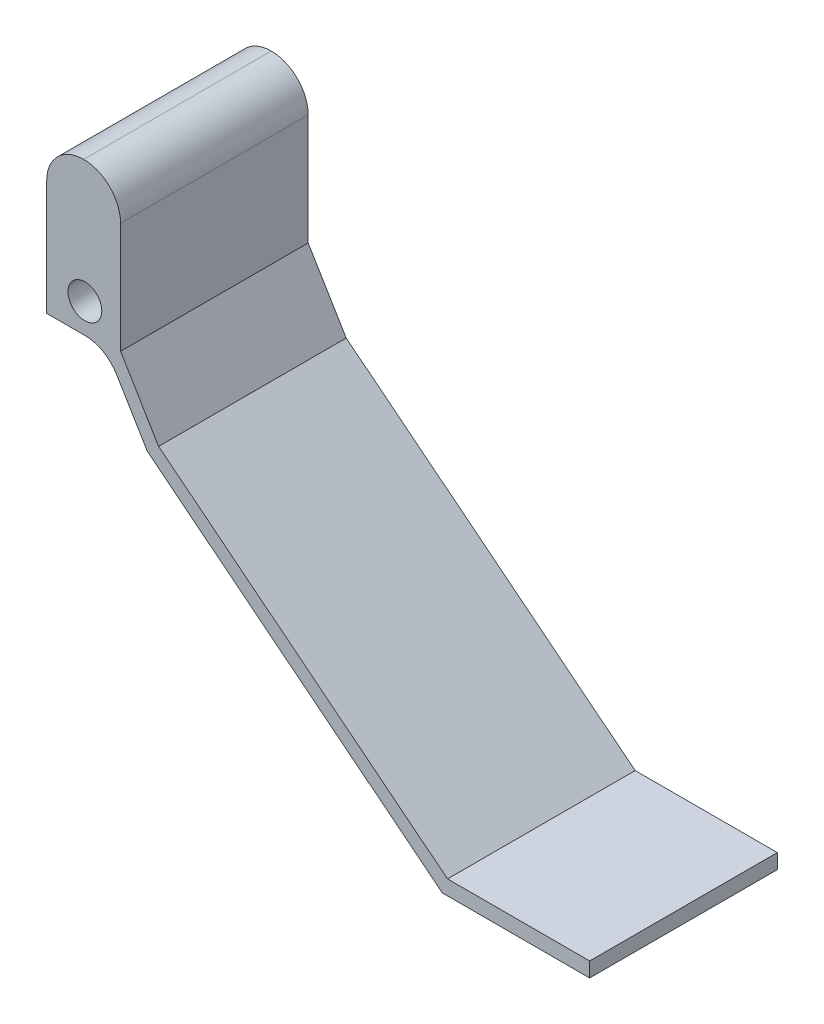
ISO-10303-21;
HEADER;
FILE_DESCRIPTION(('STEP AP214'),'2;1');
FILE_NAME('part.step','',(''),(''),'','','');
FILE_SCHEMA(('AUTOMOTIVE_DESIGN { 1 0 10303 214 1 1 1 1 }'));
ENDSEC;
DATA;
#1=APPLICATION_CONTEXT('core data for automotive mechanical design processes');
#2=APPLICATION_PROTOCOL_DEFINITION('international standard','automotive_design',2000,#1);
#3=PRODUCT_CONTEXT('',#1,'mechanical');
#4=PRODUCT('Part','Part','',(#3));
#5=PRODUCT_RELATED_PRODUCT_CATEGORY('part','',(#4));
#6=PRODUCT_DEFINITION_FORMATION('','',#4);
#7=PRODUCT_DEFINITION_CONTEXT('part definition',#1,'design');
#8=PRODUCT_DEFINITION('design','',#6,#7);
#9=PRODUCT_DEFINITION_SHAPE('','',#8);
#10=(LENGTH_UNIT() NAMED_UNIT(*) SI_UNIT(.MILLI.,.METRE.));
#11=(NAMED_UNIT(*) PLANE_ANGLE_UNIT() SI_UNIT($,.RADIAN.));
#12=(NAMED_UNIT(*) SI_UNIT($,.STERADIAN.) SOLID_ANGLE_UNIT());
#13=UNCERTAINTY_MEASURE_WITH_UNIT(LENGTH_MEASURE(1.E-05),#10,'distance_accuracy_value','');
#14=(GEOMETRIC_REPRESENTATION_CONTEXT(3) GLOBAL_UNCERTAINTY_ASSIGNED_CONTEXT((#13)) GLOBAL_UNIT_ASSIGNED_CONTEXT((#10,
#11,#12)) REPRESENTATION_CONTEXT('',''));
#15=CARTESIAN_POINT('',(0.,0.,0.));
#16=DIRECTION('',(0.,0.,1.));
#17=DIRECTION('',(1.,0.,0.));
#18=AXIS2_PLACEMENT_3D('',#15,#16,#17);
#19=CARTESIAN_POINT('',(-10.,20.,25.4));
#20=DIRECTION('',(1.,0.,0.));
#21=DIRECTION('',(0.,0.,-1.));
#22=AXIS2_PLACEMENT_3D('',#19,#20,#21);
#23=PLANE('',#22);
#24=DIRECTION('',(0.,-1.,0.));
#25=VECTOR('',#24,1.);
#26=CARTESIAN_POINT('',(-10.,20.,25.4));
#27=LINE('',#26,#25);
#28=CARTESIAN_POINT('',(-10.,15.,25.4));
#29=VERTEX_POINT('',#28);
#30=CARTESIAN_POINT('',(-10.,-0.554309869384187,25.4));
#31=VERTEX_POINT('',#30);
#32=EDGE_CURVE('E137',#29,#31,#27,.T.);
#33=ORIENTED_EDGE('',*,*,#32,.F.);
#34=DIRECTION('',(0.,0.,-1.));
#35=VECTOR('',#34,1.);
#36=CARTESIAN_POINT('',(-10.,15.,25.4));
#37=LINE('',#36,#35);
#38=CARTESIAN_POINT('',(-10.,15.,0.));
#39=VERTEX_POINT('',#38);
#40=EDGE_CURVE('E193',#29,#39,#37,.T.);
#41=ORIENTED_EDGE('',*,*,#40,.T.);
#42=DIRECTION('',(0.,-1.,0.));
#43=VECTOR('',#42,1.);
#44=CARTESIAN_POINT('',(-10.,20.,0.));
#45=LINE('',#44,#43);
#46=CARTESIAN_POINT('',(-10.,-0.554309869384187,0.));
#47=VERTEX_POINT('',#46);
#48=EDGE_CURVE('E158',#39,#47,#45,.T.);
#49=ORIENTED_EDGE('',*,*,#48,.T.);
#50=DIRECTION('',(0.,0.,-1.));
#51=VECTOR('',#50,1.);
#52=CARTESIAN_POINT('',(-10.,-0.554309869384187,25.4));
#53=LINE('',#52,#51);
#54=EDGE_CURVE('E151',#31,#47,#53,.T.);
#55=ORIENTED_EDGE('',*,*,#54,.F.);
#56=EDGE_LOOP('',(#33,#41,#49,#55));
#57=FACE_BOUND('',#56,.T.);
#58=ADVANCED_FACE('F45',(#57),#23,.F.);
#59=CARTESIAN_POINT('',(-2.,-0.554309869384186,25.4));
#60=DIRECTION('',(0.,-1.,0.));
#61=DIRECTION('',(1.,0.,0.));
#62=AXIS2_PLACEMENT_3D('',#59,#60,#61);
#63=PLANE('',#62);
#64=DIRECTION('',(-1.,0.,0.));
#65=VECTOR('',#64,1.);
#66=CARTESIAN_POINT('',(-2.,-0.554309869384186,0.));
#67=LINE('',#66,#65);
#68=CARTESIAN_POINT('',(-4.82990358363285,-0.554309869384187,0.));
#69=VERTEX_POINT('',#68);
#70=EDGE_CURVE('E272',#69,#47,#67,.T.);
#71=ORIENTED_EDGE('',*,*,#70,.F.);
#72=DIRECTION('',(0.,0.,-1.));
#73=VECTOR('',#72,1.);
#74=CARTESIAN_POINT('',(-4.82990358363285,-0.554309869384187,25.4));
#75=LINE('',#74,#73);
#76=CARTESIAN_POINT('',(-4.82990358363285,-0.554309869384187,25.4));
#77=VERTEX_POINT('',#76);
#78=EDGE_CURVE('E153',#69,#77,#75,.F.);
#79=ORIENTED_EDGE('',*,*,#78,.T.);
#80=DIRECTION('',(-1.,0.,0.));
#81=VECTOR('',#80,1.);
#82=CARTESIAN_POINT('',(-2.,-0.554309869384186,25.4));
#83=LINE('',#82,#81);
#84=EDGE_CURVE('E140',#77,#31,#83,.T.);
#85=ORIENTED_EDGE('',*,*,#84,.T.);
#86=ORIENTED_EDGE('',*,*,#54,.T.);
#87=EDGE_LOOP('',(#71,#79,#85,#86));
#88=FACE_BOUND('',#87,.T.);
#89=ADVANCED_FACE('F150',(#88),#63,.T.);
#90=CARTESIAN_POINT('',(-2.,-0.554309869384186,25.4));
#91=DIRECTION('',(0.857329498630078,0.514768035894517,0.));
#92=DIRECTION('',(-0.514768035894517,0.857329498630078,0.));
#93=AXIS2_PLACEMENT_3D('',#90,#91,#92);
#94=PLANE('',#93);
#95=DIRECTION('',(0.514768035894517,-0.857329498630078,0.));
#96=VECTOR('',#95,1.);
#97=CARTESIAN_POINT('',(-2.,-0.554309869384186,25.4));
#98=LINE('',#97,#96);
#99=CARTESIAN_POINT('',(-0.543256090482461,-2.9804696899116,25.4));
#100=VERTEX_POINT('',#99);
#101=CARTESIAN_POINT('',(3.61907341225925,-9.91269472505337,25.4));
#102=VERTEX_POINT('',#101);
#103=EDGE_CURVE('E155',#100,#102,#98,.T.);
#104=ORIENTED_EDGE('',*,*,#103,.F.);
#105=DIRECTION('',(0.,0.,-1.));
#106=VECTOR('',#105,1.);
#107=CARTESIAN_POINT('',(-0.543256090482461,-2.9804696899116,25.4));
#108=LINE('',#107,#106);
#109=CARTESIAN_POINT('',(-0.543256090482461,-2.9804696899116,0.));
#110=VERTEX_POINT('',#109);
#111=EDGE_CURVE('E161',#100,#110,#108,.T.);
#112=ORIENTED_EDGE('',*,*,#111,.T.);
#113=DIRECTION('',(0.514768035894517,-0.857329498630078,0.));
#114=VECTOR('',#113,1.);
#115=CARTESIAN_POINT('',(-2.,-0.554309869384186,0.));
#116=LINE('',#115,#114);
#117=CARTESIAN_POINT('',(3.61907341225925,-9.91269472505337,0.));
#118=VERTEX_POINT('',#117);
#119=EDGE_CURVE('E276',#110,#118,#116,.T.);
#120=ORIENTED_EDGE('',*,*,#119,.T.);
#121=DIRECTION('',(0.,0.,-1.));
#122=VECTOR('',#121,1.);
#123=CARTESIAN_POINT('',(3.61907341225925,-9.91269472505337,25.4));
#124=LINE('',#123,#122);
#125=EDGE_CURVE('E162',#102,#118,#124,.T.);
#126=ORIENTED_EDGE('',*,*,#125,.F.);
#127=EDGE_LOOP('',(#104,#112,#120,#126));
#128=FACE_BOUND('',#127,.T.);
#129=ADVANCED_FACE('F222',(#128),#94,.F.);
#130=CARTESIAN_POINT('',(3.61907341225925,-9.91269472505337,25.4));
#131=DIRECTION('',(0.622935380390465,0.782273297420912,0.));
#132=DIRECTION('',(-0.782273297420912,0.622935380390465,0.));
#133=AXIS2_PLACEMENT_3D('',#130,#131,#132);
#134=PLANE('',#133);
#135=DIRECTION('',(0.782273297420912,-0.622935380390464,0.));
#136=VECTOR('',#135,1.);
#137=CARTESIAN_POINT('',(3.61907341225925,-9.91269472505337,0.));
#138=LINE('',#137,#136);
#139=CARTESIAN_POINT('',(43.5623105967593,-41.720064005824,0.));
#140=VERTEX_POINT('',#139);
#141=EDGE_CURVE('E279',#118,#140,#138,.T.);
#142=ORIENTED_EDGE('',*,*,#141,.T.);
#143=DIRECTION('',(0.,0.,-1.));
#144=VECTOR('',#143,1.);
#145=CARTESIAN_POINT('',(43.5623105967593,-41.720064005824,25.4));
#146=LINE('',#145,#144);
#147=CARTESIAN_POINT('',(43.5623105967593,-41.720064005824,25.4));
#148=VERTEX_POINT('',#147);
#149=EDGE_CURVE('E169',#148,#140,#146,.T.);
#150=ORIENTED_EDGE('',*,*,#149,.F.);
#151=DIRECTION('',(0.782273297420912,-0.622935380390464,0.));
#152=VECTOR('',#151,1.);
#153=CARTESIAN_POINT('',(3.61907341225925,-9.91269472505337,25.4));
#154=LINE('',#153,#152);
#155=EDGE_CURVE('E241',#102,#148,#154,.T.);
#156=ORIENTED_EDGE('',*,*,#155,.F.);
#157=ORIENTED_EDGE('',*,*,#125,.T.);
#158=EDGE_LOOP('',(#142,#150,#156,#157));
#159=FACE_BOUND('',#158,.T.);
#160=ADVANCED_FACE('F362',(#159),#134,.F.);
#161=CARTESIAN_POINT('',(43.5623105967593,-41.720064005824,25.4));
#162=DIRECTION('',(0.,1.,0.));
#163=DIRECTION('',(0.,0.,1.));
#164=AXIS2_PLACEMENT_3D('',#161,#162,#163);
#165=PLANE('',#164);
#166=DIRECTION('',(1.,0.,0.));
#167=VECTOR('',#166,1.);
#168=CARTESIAN_POINT('',(43.5623105967593,-41.720064005824,0.));
#169=LINE('',#168,#167);
#170=CARTESIAN_POINT('',(63.5,-41.720064005824,0.));
#171=VERTEX_POINT('',#170);
#172=EDGE_CURVE('E282',#140,#171,#169,.T.);
#173=ORIENTED_EDGE('',*,*,#172,.T.);
#174=DIRECTION('',(0.,0.,-1.));
#175=VECTOR('',#174,1.);
#176=CARTESIAN_POINT('',(63.5,-41.720064005824,25.4));
#177=LINE('',#176,#175);
#178=CARTESIAN_POINT('',(63.5,-41.720064005824,25.4));
#179=VERTEX_POINT('',#178);
#180=EDGE_CURVE('E315',#179,#171,#177,.T.);
#181=ORIENTED_EDGE('',*,*,#180,.F.);
#182=DIRECTION('',(1.,0.,0.));
#183=VECTOR('',#182,1.);
#184=CARTESIAN_POINT('',(43.5623105967593,-41.720064005824,25.4));
#185=LINE('',#184,#183);
#186=EDGE_CURVE('E244',#148,#179,#185,.T.);
#187=ORIENTED_EDGE('',*,*,#186,.F.);
#188=ORIENTED_EDGE('',*,*,#149,.T.);
#189=EDGE_LOOP('',(#173,#181,#187,#188));
#190=FACE_BOUND('',#189,.T.);
#191=ADVANCED_FACE('F323',(#190),#165,.F.);
#192=CARTESIAN_POINT('',(63.5,-39.720064005824,25.4));
#193=DIRECTION('',(1.,0.,0.));
#194=DIRECTION('',(0.,0.,-1.));
#195=AXIS2_PLACEMENT_3D('',#192,#193,#194);
#196=PLANE('',#195);
#197=DIRECTION('',(0.,-1.,0.));
#198=VECTOR('',#197,1.);
#199=CARTESIAN_POINT('',(63.5,-39.720064005824,0.));
#200=LINE('',#199,#198);
#201=CARTESIAN_POINT('',(63.5,-39.720064005824,0.));
#202=VERTEX_POINT('',#201);
#203=EDGE_CURVE('E286',#202,#171,#200,.T.);
#204=ORIENTED_EDGE('',*,*,#203,.F.);
#205=DIRECTION('',(0.,0.,-1.));
#206=VECTOR('',#205,1.);
#207=CARTESIAN_POINT('',(63.5,-39.720064005824,25.4));
#208=LINE('',#207,#206);
#209=CARTESIAN_POINT('',(63.5,-39.720064005824,25.4));
#210=VERTEX_POINT('',#209);
#211=EDGE_CURVE('E312',#210,#202,#208,.T.);
#212=ORIENTED_EDGE('',*,*,#211,.F.);
#213=DIRECTION('',(0.,-1.,0.));
#214=VECTOR('',#213,1.);
#215=CARTESIAN_POINT('',(63.5,-39.720064005824,25.4));
#216=LINE('',#215,#214);
#217=EDGE_CURVE('E249',#210,#179,#216,.T.);
#218=ORIENTED_EDGE('',*,*,#217,.T.);
#219=ORIENTED_EDGE('',*,*,#180,.T.);
#220=EDGE_LOOP('',(#204,#212,#218,#219));
#221=FACE_BOUND('',#220,.T.);
#222=ADVANCED_FACE('F330',(#221),#196,.T.);
#223=CARTESIAN_POINT('',(44.2613452299908,-39.720064005824,25.4));
#224=DIRECTION('',(0.,1.,0.));
#225=DIRECTION('',(0.,0.,1.));
#226=AXIS2_PLACEMENT_3D('',#223,#224,#225);
#227=PLANE('',#226);
#228=DIRECTION('',(1.,0.,0.));
#229=VECTOR('',#228,1.);
#230=CARTESIAN_POINT('',(44.2613452299908,-39.720064005824,0.));
#231=LINE('',#230,#229);
#232=CARTESIAN_POINT('',(44.2613452299908,-39.720064005824,0.));
#233=VERTEX_POINT('',#232);
#234=EDGE_CURVE('E290',#233,#202,#231,.T.);
#235=ORIENTED_EDGE('',*,*,#234,.F.);
#236=DIRECTION('',(0.,0.,-1.));
#237=VECTOR('',#236,1.);
#238=CARTESIAN_POINT('',(44.2613452299908,-39.720064005824,25.4));
#239=LINE('',#238,#237);
#240=CARTESIAN_POINT('',(44.2613452299908,-39.720064005824,25.4));
#241=VERTEX_POINT('',#240);
#242=EDGE_CURVE('E309',#241,#233,#239,.T.);
#243=ORIENTED_EDGE('',*,*,#242,.F.);
#244=DIRECTION('',(1.,0.,0.));
#245=VECTOR('',#244,1.);
#246=CARTESIAN_POINT('',(44.2613452299908,-39.720064005824,25.4));
#247=LINE('',#246,#245);
#248=EDGE_CURVE('E253',#241,#210,#247,.T.);
#249=ORIENTED_EDGE('',*,*,#248,.T.);
#250=ORIENTED_EDGE('',*,*,#211,.T.);
#251=EDGE_LOOP('',(#235,#243,#249,#250));
#252=FACE_BOUND('',#251,.T.);
#253=ADVANCED_FACE('F335',(#252),#227,.T.);
#254=CARTESIAN_POINT('',(5.14768035894517,-8.57329498630078,25.4));
#255=DIRECTION('',(0.622935380390465,0.782273297420912,0.));
#256=DIRECTION('',(-0.782273297420912,0.622935380390465,0.));
#257=AXIS2_PLACEMENT_3D('',#254,#255,#256);
#258=PLANE('',#257);
#259=DIRECTION('',(0.782273297420912,-0.622935380390465,0.));
#260=VECTOR('',#259,1.);
#261=CARTESIAN_POINT('',(5.14768035894517,-8.57329498630078,0.));
#262=LINE('',#261,#260);
#263=CARTESIAN_POINT('',(5.14768035894517,-8.57329498630078,0.));
#264=VERTEX_POINT('',#263);
#265=EDGE_CURVE('E294',#264,#233,#262,.T.);
#266=ORIENTED_EDGE('',*,*,#265,.F.);
#267=DIRECTION('',(0.,0.,-1.));
#268=VECTOR('',#267,1.);
#269=CARTESIAN_POINT('',(5.14768035894517,-8.57329498630078,25.4));
#270=LINE('',#269,#268);
#271=CARTESIAN_POINT('',(5.14768035894517,-8.57329498630078,25.4));
#272=VERTEX_POINT('',#271);
#273=EDGE_CURVE('E306',#272,#264,#270,.T.);
#274=ORIENTED_EDGE('',*,*,#273,.F.);
#275=DIRECTION('',(0.782273297420912,-0.622935380390465,0.));
#276=VECTOR('',#275,1.);
#277=CARTESIAN_POINT('',(5.14768035894517,-8.57329498630078,25.4));
#278=LINE('',#277,#276);
#279=EDGE_CURVE('E257',#272,#241,#278,.T.);
#280=ORIENTED_EDGE('',*,*,#279,.T.);
#281=ORIENTED_EDGE('',*,*,#242,.T.);
#282=EDGE_LOOP('',(#266,#274,#280,#281));
#283=FACE_BOUND('',#282,.T.);
#284=ADVANCED_FACE('F338',(#283),#258,.T.);
#285=CARTESIAN_POINT('',(0.,0.,25.4));
#286=DIRECTION('',(0.857329498630078,0.514768035894517,0.));
#287=DIRECTION('',(-0.514768035894517,0.857329498630078,0.));
#288=AXIS2_PLACEMENT_3D('',#285,#286,#287);
#289=PLANE('',#288);
#290=DIRECTION('',(0.514768035894517,-0.857329498630078,0.));
#291=VECTOR('',#290,1.);
#292=CARTESIAN_POINT('',(0.,0.,0.));
#293=LINE('',#292,#291);
#294=CARTESIAN_POINT('',(0.,0.,0.));
#295=VERTEX_POINT('',#294);
#296=EDGE_CURVE('E298',#295,#264,#293,.T.);
#297=ORIENTED_EDGE('',*,*,#296,.F.);
#298=DIRECTION('',(0.,0.,-1.));
#299=VECTOR('',#298,1.);
#300=CARTESIAN_POINT('',(0.,0.,25.4));
#301=LINE('',#300,#299);
#302=CARTESIAN_POINT('',(0.,0.,25.4));
#303=VERTEX_POINT('',#302);
#304=EDGE_CURVE('E269',#303,#295,#301,.T.);
#305=ORIENTED_EDGE('',*,*,#304,.F.);
#306=DIRECTION('',(0.514768035894517,-0.857329498630078,0.));
#307=VECTOR('',#306,1.);
#308=CARTESIAN_POINT('',(0.,0.,25.4));
#309=LINE('',#308,#307);
#310=EDGE_CURVE('E261',#303,#272,#309,.T.);
#311=ORIENTED_EDGE('',*,*,#310,.T.);
#312=ORIENTED_EDGE('',*,*,#273,.T.);
#313=EDGE_LOOP('',(#297,#305,#311,#312));
#314=FACE_BOUND('',#313,.T.);
#315=ADVANCED_FACE('F342',(#314),#289,.T.);
#316=CARTESIAN_POINT('',(0.,0.,25.4));
#317=DIRECTION('',(-1.,0.,0.));
#318=DIRECTION('',(0.,0.,1.));
#319=AXIS2_PLACEMENT_3D('',#316,#317,#318);
#320=PLANE('',#319);
#321=DIRECTION('',(0.,1.,0.));
#322=VECTOR('',#321,1.);
#323=CARTESIAN_POINT('',(0.,0.,0.));
#324=LINE('',#323,#322);
#325=CARTESIAN_POINT('',(0.,15.,0.));
#326=VERTEX_POINT('',#325);
#327=EDGE_CURVE('E145',#295,#326,#324,.T.);
#328=ORIENTED_EDGE('',*,*,#327,.T.);
#329=DIRECTION('',(0.,0.,-1.));
#330=VECTOR('',#329,1.);
#331=CARTESIAN_POINT('',(0.,15.,25.4));
#332=LINE('',#331,#330);
#333=CARTESIAN_POINT('',(0.,15.,25.4));
#334=VERTEX_POINT('',#333);
#335=EDGE_CURVE('E187',#326,#334,#332,.F.);
#336=ORIENTED_EDGE('',*,*,#335,.T.);
#337=DIRECTION('',(0.,1.,0.));
#338=VECTOR('',#337,1.);
#339=CARTESIAN_POINT('',(0.,0.,25.4));
#340=LINE('',#339,#338);
#341=EDGE_CURVE('E265',#303,#334,#340,.T.);
#342=ORIENTED_EDGE('',*,*,#341,.F.);
#343=ORIENTED_EDGE('',*,*,#304,.T.);
#344=EDGE_LOOP('',(#328,#336,#342,#343));
#345=FACE_BOUND('',#344,.T.);
#346=ADVANCED_FACE('F345',(#345),#320,.F.);
#347=CARTESIAN_POINT('',(0.,0.,25.4));
#348=DIRECTION('',(0.,0.,1.));
#349=DIRECTION('',(1.,0.,0.));
#350=AXIS2_PLACEMENT_3D('',#347,#348,#349);
#351=PLANE('',#350);
#352=CARTESIAN_POINT('',(-4.82990358363285,3.44569013061581,25.4));
#353=DIRECTION('',(0.,0.,1.));
#354=DIRECTION('',(1.,0.,0.));
#355=AXIS2_PLACEMENT_3D('',#352,#353,#354);
#356=CIRCLE('',#355,2.286);
#357=CARTESIAN_POINT('',(-2.54390358363285,3.44569013061581,25.4));
#358=VERTEX_POINT('',#357);
#359=EDGE_CURVE('E454',#358,#358,#356,.T.);
#360=ORIENTED_EDGE('',*,*,#359,.F.);
#361=EDGE_LOOP('',(#360));
#362=FACE_BOUND('',#361,.T.);
#363=CARTESIAN_POINT('',(-5.,15.,25.4));
#364=DIRECTION('',(0.,0.,1.));
#365=DIRECTION('',(1.,0.,0.));
#366=AXIS2_PLACEMENT_3D('',#363,#364,#365);
#367=CIRCLE('',#366,5.);
#368=CARTESIAN_POINT('',(-5.,20.,25.4));
#369=VERTEX_POINT('',#368);
#370=EDGE_CURVE('E190',#334,#369,#367,.T.);
#371=ORIENTED_EDGE('',*,*,#370,.T.);
#372=CARTESIAN_POINT('',(-5.,15.,25.4));
#373=DIRECTION('',(0.,0.,1.));
#374=DIRECTION('',(1.,0.,0.));
#375=AXIS2_PLACEMENT_3D('',#372,#373,#374);
#376=CIRCLE('',#375,5.);
#377=EDGE_CURVE('E11',#369,#29,#376,.T.);
#378=ORIENTED_EDGE('',*,*,#377,.T.);
#379=ORIENTED_EDGE('',*,*,#32,.T.);
#380=ORIENTED_EDGE('',*,*,#84,.F.);
#381=CARTESIAN_POINT('',(-4.82990358363285,-5.55430986938419,25.4));
#382=DIRECTION('',(0.,0.,1.));
#383=DIRECTION('',(1.,0.,0.));
#384=AXIS2_PLACEMENT_3D('',#381,#382,#383);
#385=CIRCLE('',#384,5.);
#386=EDGE_CURVE('E178',#77,#100,#385,.F.);
#387=ORIENTED_EDGE('',*,*,#386,.T.);
#388=ORIENTED_EDGE('',*,*,#103,.T.);
#389=ORIENTED_EDGE('',*,*,#155,.T.);
#390=ORIENTED_EDGE('',*,*,#186,.T.);
#391=ORIENTED_EDGE('',*,*,#217,.F.);
#392=ORIENTED_EDGE('',*,*,#248,.F.);
#393=ORIENTED_EDGE('',*,*,#279,.F.);
#394=ORIENTED_EDGE('',*,*,#310,.F.);
#395=ORIENTED_EDGE('',*,*,#341,.T.);
#396=EDGE_LOOP('',(#371,#378,#379,#380,#387,#388,#389,#390,#391,#392,#393,#394,#395));
#397=FACE_BOUND('',#396,.T.);
#398=ADVANCED_FACE('F139',(#362,#397),#351,.T.);
#399=CARTESIAN_POINT('',(0.,0.,0.));
#400=DIRECTION('',(0.,0.,1.));
#401=DIRECTION('',(1.,0.,0.));
#402=AXIS2_PLACEMENT_3D('',#399,#400,#401);
#403=PLANE('',#402);
#404=CARTESIAN_POINT('',(-4.82990358363285,3.44569013061581,0.));
#405=DIRECTION('',(0.,0.,1.));
#406=DIRECTION('',(1.,0.,0.));
#407=AXIS2_PLACEMENT_3D('',#404,#405,#406);
#408=CIRCLE('',#407,2.286);
#409=CARTESIAN_POINT('',(-2.54390358363285,3.44569013061581,0.));
#410=VERTEX_POINT('',#409);
#411=EDGE_CURVE('E273',#410,#410,#408,.T.);
#412=ORIENTED_EDGE('',*,*,#411,.T.);
#413=EDGE_LOOP('',(#412));
#414=FACE_BOUND('',#413,.T.);
#415=ORIENTED_EDGE('',*,*,#48,.F.);
#416=CARTESIAN_POINT('',(-5.,15.,0.));
#417=DIRECTION('',(0.,0.,1.));
#418=DIRECTION('',(1.,0.,0.));
#419=AXIS2_PLACEMENT_3D('',#416,#417,#418);
#420=CIRCLE('',#419,5.);
#421=CARTESIAN_POINT('',(-5.,20.,0.));
#422=VERTEX_POINT('',#421);
#423=EDGE_CURVE('E54',#39,#422,#420,.F.);
#424=ORIENTED_EDGE('',*,*,#423,.T.);
#425=CARTESIAN_POINT('',(-5.,15.,0.));
#426=DIRECTION('',(0.,0.,1.));
#427=DIRECTION('',(1.,0.,0.));
#428=AXIS2_PLACEMENT_3D('',#425,#426,#427);
#429=CIRCLE('',#428,5.);
#430=EDGE_CURVE('E184',#422,#326,#429,.F.);
#431=ORIENTED_EDGE('',*,*,#430,.T.);
#432=ORIENTED_EDGE('',*,*,#327,.F.);
#433=ORIENTED_EDGE('',*,*,#296,.T.);
#434=ORIENTED_EDGE('',*,*,#265,.T.);
#435=ORIENTED_EDGE('',*,*,#234,.T.);
#436=ORIENTED_EDGE('',*,*,#203,.T.);
#437=ORIENTED_EDGE('',*,*,#172,.F.);
#438=ORIENTED_EDGE('',*,*,#141,.F.);
#439=ORIENTED_EDGE('',*,*,#119,.F.);
#440=CARTESIAN_POINT('',(-4.82990358363285,-5.55430986938419,0.));
#441=DIRECTION('',(0.,0.,1.));
#442=DIRECTION('',(1.,0.,0.));
#443=AXIS2_PLACEMENT_3D('',#440,#441,#442);
#444=CIRCLE('',#443,5.);
#445=EDGE_CURVE('E175',#110,#69,#444,.T.);
#446=ORIENTED_EDGE('',*,*,#445,.T.);
#447=ORIENTED_EDGE('',*,*,#70,.T.);
#448=EDGE_LOOP('',(#415,#424,#431,#432,#433,#434,#435,#436,#437,#438,#439,#446,#447));
#449=FACE_BOUND('',#448,.T.);
#450=ADVANCED_FACE('F198',(#414,#449),#403,.F.);
#451=CARTESIAN_POINT('',(-4.82990358363285,-5.55430986938419,25.4));
#452=DIRECTION('',(0.,0.,-1.));
#453=DIRECTION('',(-1.,0.,0.));
#454=AXIS2_PLACEMENT_3D('',#451,#452,#453);
#455=CYLINDRICAL_SURFACE('',#454,5.);
#456=ORIENTED_EDGE('',*,*,#386,.F.);
#457=ORIENTED_EDGE('',*,*,#78,.F.);
#458=ORIENTED_EDGE('',*,*,#445,.F.);
#459=ORIENTED_EDGE('',*,*,#111,.F.);
#460=EDGE_LOOP('',(#456,#457,#458,#459));
#461=FACE_BOUND('',#460,.T.);
#462=ADVANCED_FACE('F215',(#461),#455,.F.);
#463=CARTESIAN_POINT('',(-5.,15.,25.4));
#464=DIRECTION('',(0.,0.,-1.));
#465=DIRECTION('',(-1.,0.,0.));
#466=AXIS2_PLACEMENT_3D('',#463,#464,#465);
#467=CYLINDRICAL_SURFACE('',#466,5.);
#468=ORIENTED_EDGE('',*,*,#370,.F.);
#469=ORIENTED_EDGE('',*,*,#335,.F.);
#470=ORIENTED_EDGE('',*,*,#430,.F.);
#471=DIRECTION('',(0.,0.,-1.));
#472=VECTOR('',#471,1.);
#473=CARTESIAN_POINT('',(-5.,20.,25.4));
#474=LINE('',#473,#472);
#475=EDGE_CURVE('E181',#369,#422,#474,.T.);
#476=ORIENTED_EDGE('',*,*,#475,.F.);
#477=EDGE_LOOP('',(#468,#469,#470,#476));
#478=FACE_BOUND('',#477,.T.);
#479=ADVANCED_FACE('F205',(#478),#467,.T.);
#480=CARTESIAN_POINT('',(-5.,15.,25.4));
#481=DIRECTION('',(0.,0.,-1.));
#482=DIRECTION('',(-1.,0.,0.));
#483=AXIS2_PLACEMENT_3D('',#480,#481,#482);
#484=CYLINDRICAL_SURFACE('',#483,5.);
#485=ORIENTED_EDGE('',*,*,#377,.F.);
#486=ORIENTED_EDGE('',*,*,#475,.T.);
#487=ORIENTED_EDGE('',*,*,#423,.F.);
#488=ORIENTED_EDGE('',*,*,#40,.F.);
#489=EDGE_LOOP('',(#485,#486,#487,#488));
#490=FACE_BOUND('',#489,.T.);
#491=ADVANCED_FACE('F47',(#490),#484,.T.);
#492=CARTESIAN_POINT('',(-4.82990358363285,3.44569013061581,0.));
#493=DIRECTION('',(0.,0.,1.));
#494=DIRECTION('',(1.,0.,0.));
#495=AXIS2_PLACEMENT_3D('',#492,#493,#494);
#496=CYLINDRICAL_SURFACE('',#495,2.286);
#497=ORIENTED_EDGE('',*,*,#411,.F.);
#498=EDGE_LOOP('',(#497));
#499=FACE_BOUND('',#498,.T.);
#500=ORIENTED_EDGE('',*,*,#359,.T.);
#501=EDGE_LOOP('',(#500));
#502=FACE_BOUND('',#501,.T.);
#503=ADVANCED_FACE('F207',(#499,#502),#496,.F.);
#504=CLOSED_SHELL('',(#58,#89,#129,#160,#191,#222,#253,#284,#315,#346,#398,#450,#462,#479,#491,#503));
#505=MANIFOLD_SOLID_BREP('B2',#504);
#506=ADVANCED_BREP_SHAPE_REPRESENTATION('',(#18,#505),#14);
#507=SHAPE_DEFINITION_REPRESENTATION(#9,#506);
ENDSEC;
END-ISO-10303-21;
